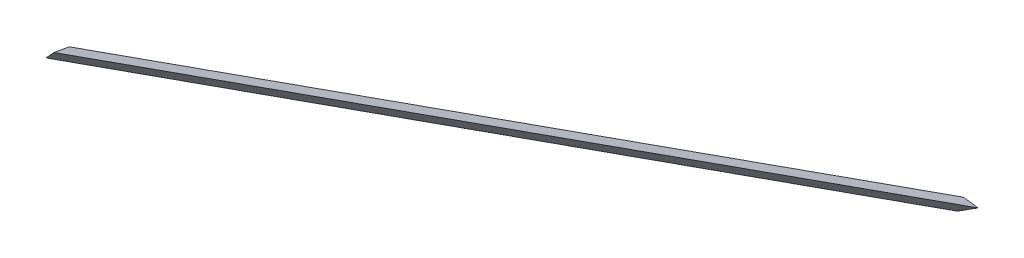
ISO-10303-21;
HEADER;
FILE_DESCRIPTION(('STEP AP214'),'2;1');
FILE_NAME('part.step','',(''),(''),'','','');
FILE_SCHEMA(('AUTOMOTIVE_DESIGN { 1 0 10303 214 1 1 1 1 }'));
ENDSEC;
DATA;
#1=APPLICATION_CONTEXT('core data for automotive mechanical design processes');
#2=APPLICATION_PROTOCOL_DEFINITION('international standard','automotive_design',2000,#1);
#3=PRODUCT_CONTEXT('',#1,'mechanical');
#4=PRODUCT('Part','Part','',(#3));
#5=PRODUCT_RELATED_PRODUCT_CATEGORY('part','',(#4));
#6=PRODUCT_DEFINITION_FORMATION('','',#4);
#7=PRODUCT_DEFINITION_CONTEXT('part definition',#1,'design');
#8=PRODUCT_DEFINITION('design','',#6,#7);
#9=PRODUCT_DEFINITION_SHAPE('','',#8);
#10=(LENGTH_UNIT() NAMED_UNIT(*) SI_UNIT(.MILLI.,.METRE.));
#11=(NAMED_UNIT(*) PLANE_ANGLE_UNIT() SI_UNIT($,.RADIAN.));
#12=(NAMED_UNIT(*) SI_UNIT($,.STERADIAN.) SOLID_ANGLE_UNIT());
#13=UNCERTAINTY_MEASURE_WITH_UNIT(LENGTH_MEASURE(1.E-05),#10,'distance_accuracy_value','');
#14=(GEOMETRIC_REPRESENTATION_CONTEXT(3) GLOBAL_UNCERTAINTY_ASSIGNED_CONTEXT((#13)) GLOBAL_UNIT_ASSIGNED_CONTEXT((#10,
#11,#12)) REPRESENTATION_CONTEXT('',''));
#15=CARTESIAN_POINT('',(0.,0.,0.));
#16=DIRECTION('',(0.,0.,1.));
#17=DIRECTION('',(1.,0.,0.));
#18=AXIS2_PLACEMENT_3D('',#15,#16,#17);
#19=CARTESIAN_POINT('',(-11.0804138166546,17.3620696147899,-14.0549311058843));
#20=DIRECTION('',(0.444370527755255,-0.696290965780646,0.563661001875038));
#21=DIRECTION('',(0.,-0.629196129232445,-0.777246570245832));
#22=AXIS2_PLACEMENT_3D('',#19,#20,#21);
#23=PLANE('',#22);
#24=DIRECTION('',(-0.842960923517803,-0.537974796270246,0.));
#25=VECTOR('',#24,1.);
#26=CARTESIAN_POINT('',(-25.3451585873898,39.7137160284348,24.8019022697649));
#27=LINE('',#26,#25);
#28=CARTESIAN_POINT('',(6291.01982076721,4070.79637730235,24.8019022629516));
#29=VERTEX_POINT('',#28);
#30=CARTESIAN_POINT('',(6204.72943877632,4015.72614880598,24.8019022629518));
#31=VERTEX_POINT('',#30);
#32=EDGE_CURVE('E91',#29,#31,#27,.T.);
#33=ORIENTED_EDGE('',*,*,#32,.T.);
#34=DIRECTION('',(0.467086179481371,-0.356822089773106,-0.809016994374933));
#35=VECTOR('',#34,1.);
#36=CARTESIAN_POINT('',(5529.70657588738,4531.39772968844,1193.97579704742));
#37=LINE('',#36,#35);
#38=CARTESIAN_POINT('',(4854.68371300804,5047.06931056174,2363.14969182498));
#39=VERTEX_POINT('',#38);
#40=EDGE_CURVE('E105',#39,#31,#37,.T.);
#41=ORIENTED_EDGE('',*,*,#40,.F.);
#42=DIRECTION('',(0.654469130781618,0.6819697127199,0.326477361828795));
#43=VECTOR('',#42,1.);
#44=CARTESIAN_POINT('',(17.696146111748,6.8330850785718,-49.7478242931942));
#45=LINE('',#44,#43);
#46=CARTESIAN_POINT('',(4921.67897900533,5116.87969604348,2396.56981306384));
#47=VERTEX_POINT('',#46);
#48=EDGE_CURVE('E48',#39,#47,#45,.T.);
#49=ORIENTED_EDGE('',*,*,#48,.T.);
#50=DIRECTION('',(-0.467086179481371,0.356822089773106,0.809016994374933));
#51=VECTOR('',#50,1.);
#52=CARTESIAN_POINT('',(5606.34939988147,4593.83803667749,1210.68585766685));
#53=LINE('',#52,#51);
#54=EDGE_CURVE('E88',#29,#47,#53,.T.);
#55=ORIENTED_EDGE('',*,*,#54,.F.);
#56=EDGE_LOOP('',(#33,#41,#49,#55));
#57=FACE_BOUND('',#56,.T.);
#58=ADVANCED_FACE('F45',(#57),#23,.F.);
#59=CARTESIAN_POINT('',(0.,0.,0.));
#60=DIRECTION('',(0.250607512160671,-0.392680737752119,0.884871579974796));
#61=DIRECTION('',(0.,-0.914039707413188,-0.405624719749689));
#62=AXIS2_PLACEMENT_3D('',#59,#60,#61);
#63=PLANE('',#62);
#64=DIRECTION('',(0.842960923517798,0.537974796270254,0.));
#65=VECTOR('',#64,1.);
#66=CARTESIAN_POINT('',(0.,0.,0.));
#67=LINE('',#66,#65);
#68=CARTESIAN_POINT('',(6239.79349851177,3982.21500247212,1.11022302462516E-13));
#69=VERTEX_POINT('',#68);
#70=CARTESIAN_POINT('',(6326.08388050264,4037.28523096847,-1.55431223447522E-12));
#71=VERTEX_POINT('',#70);
#72=EDGE_CURVE('E12',#69,#71,#67,.T.);
#73=ORIENTED_EDGE('',*,*,#72,.F.);
#74=DIRECTION('',(0.643662317162795,-0.615155867938901,-0.455282417412489));
#75=VECTOR('',#74,1.);
#76=CARTESIAN_POINT('',(5231.40828683047,4945.94095561298,713.262287717727));
#77=LINE('',#76,#75);
#78=EDGE_CURVE('E103',#31,#69,#77,.T.);
#79=ORIENTED_EDGE('',*,*,#78,.F.);
#80=ORIENTED_EDGE('',*,*,#32,.F.);
#81=DIRECTION('',(-0.643662317162795,0.615155867938901,0.455282417412489));
#82=VECTOR('',#81,1.);
#83=CARTESIAN_POINT('',(5303.75366485118,5014.33859320564,723.126023638079));
#84=LINE('',#83,#82);
#85=EDGE_CURVE('E96',#71,#29,#84,.T.);
#86=ORIENTED_EDGE('',*,*,#85,.F.);
#87=EDGE_LOOP('',(#73,#79,#80,#86));
#88=FACE_BOUND('',#87,.T.);
#89=ADVANCED_FACE('F102',(#88),#63,.F.);
#90=CARTESIAN_POINT('',(0.,0.,0.));
#91=DIRECTION('',(0.67911581020158,-0.720031948532649,0.142673436303081));
#92=DIRECTION('',(0.727474142160718,0.686135097839723,0.));
#93=AXIS2_PLACEMENT_3D('',#90,#91,#92);
#94=PLANE('',#93);
#95=ORIENTED_EDGE('',*,*,#48,.F.);
#96=DIRECTION('',(0.186329447477916,-0.0189014194816005,-0.982305488808932));
#97=VECTOR('',#96,1.);
#98=CARTESIAN_POINT('',(5136.44386522303,5018.4873182771,877.745490853306));
#99=LINE('',#98,#97);
#100=CARTESIAN_POINT('',(4844.53325568839,5048.09898168634,2416.66163035087));
#101=VERTEX_POINT('',#100);
#102=EDGE_CURVE('E94',#101,#39,#99,.T.);
#103=ORIENTED_EDGE('',*,*,#102,.F.);
#104=DIRECTION('',(-0.654469130781616,-0.681969712719901,-0.326477361828797));
#105=VECTOR('',#104,1.);
#106=CARTESIAN_POINT('',(0.,0.,0.));
#107=LINE('',#106,#105);
#108=CARTESIAN_POINT('',(4911.52852168568,5117.90936716807,2450.08175158974));
#109=VERTEX_POINT('',#108);
#110=EDGE_CURVE('E53',#109,#101,#107,.T.);
#111=ORIENTED_EDGE('',*,*,#110,.F.);
#112=DIRECTION('',(-0.186329447477916,0.0189014194816005,0.982305488808932));
#113=VECTOR('',#112,1.);
#114=CARTESIAN_POINT('',(5207.47597603096,5087.8882027477,889.883872310096));
#115=LINE('',#114,#113);
#116=EDGE_CURVE('E68',#47,#109,#115,.T.);
#117=ORIENTED_EDGE('',*,*,#116,.F.);
#118=EDGE_LOOP('',(#95,#103,#111,#117));
#119=FACE_BOUND('',#118,.T.);
#120=ADVANCED_FACE('F118',(#119),#94,.F.);
#121=CARTESIAN_POINT('',(0.,0.,0.));
#122=DIRECTION('',(0.444370527755255,-0.696290965780645,0.563661001875038));
#123=DIRECTION('',(0.,-0.629196129232445,-0.777246570245832));
#124=AXIS2_PLACEMENT_3D('',#121,#122,#123);
#125=PLANE('',#124);
#126=DIRECTION('',(-0.467086179481371,0.356822089773105,0.809016994374933));
#127=VECTOR('',#126,1.);
#128=CARTESIAN_POINT('',(5542.16337710006,4515.15699207925,1208.33081517548));
#129=LINE('',#128,#127);
#130=EDGE_CURVE('E107',#69,#101,#129,.T.);
#131=ORIENTED_EDGE('',*,*,#130,.F.);
#132=ORIENTED_EDGE('',*,*,#72,.T.);
#133=DIRECTION('',(-0.467086179481359,0.35682208977309,0.809016994374947));
#134=VECTOR('',#133,1.);
#135=CARTESIAN_POINT('',(5618.80620109418,4577.59729906827,1225.04087579491));
#136=LINE('',#135,#134);
#137=EDGE_CURVE('E98',#71,#109,#136,.T.);
#138=ORIENTED_EDGE('',*,*,#137,.T.);
#139=ORIENTED_EDGE('',*,*,#110,.T.);
#140=EDGE_LOOP('',(#131,#132,#138,#139));
#141=FACE_BOUND('',#140,.T.);
#142=ADVANCED_FACE('F119',(#141),#125,.T.);
#143=CARTESIAN_POINT('',(5281.99046233046,4854.36125243859,908.511716822624));
#144=DIRECTION('',(0.730448811768304,0.671311778017373,0.125638489649576));
#145=DIRECTION('',(-0.676673678812601,0.736283051823292,0.));
#146=AXIS2_PLACEMENT_3D('',#143,#144,#145);
#147=PLANE('',#146);
#148=ORIENTED_EDGE('',*,*,#130,.T.);
#149=ORIENTED_EDGE('',*,*,#102,.T.);
#150=ORIENTED_EDGE('',*,*,#40,.T.);
#151=ORIENTED_EDGE('',*,*,#78,.T.);
#152=EDGE_LOOP('',(#148,#149,#150,#151));
#153=FACE_BOUND('',#152,.T.);
#154=ADVANCED_FACE('F116',(#153),#147,.F.);
#155=CARTESIAN_POINT('',(5355.0353435073,4921.49243024032,921.075565787586));
#156=DIRECTION('',(-0.730448811768304,-0.671311778017372,-0.125638489649577));
#157=DIRECTION('',(0.676673678812601,-0.736283051823292,0.));
#158=AXIS2_PLACEMENT_3D('',#155,#156,#157);
#159=PLANE('',#158);
#160=ORIENTED_EDGE('',*,*,#137,.F.);
#161=ORIENTED_EDGE('',*,*,#85,.T.);
#162=ORIENTED_EDGE('',*,*,#54,.T.);
#163=ORIENTED_EDGE('',*,*,#116,.T.);
#164=EDGE_LOOP('',(#160,#161,#162,#163));
#165=FACE_BOUND('',#164,.T.);
#166=ADVANCED_FACE('F97',(#165),#159,.F.);
#167=CLOSED_SHELL('',(#58,#89,#120,#142,#154,#166));
#168=MANIFOLD_SOLID_BREP('B2',#167);
#169=ADVANCED_BREP_SHAPE_REPRESENTATION('',(#18,#168),#14);
#170=SHAPE_DEFINITION_REPRESENTATION(#9,#169);
ENDSEC;
END-ISO-10303-21;
